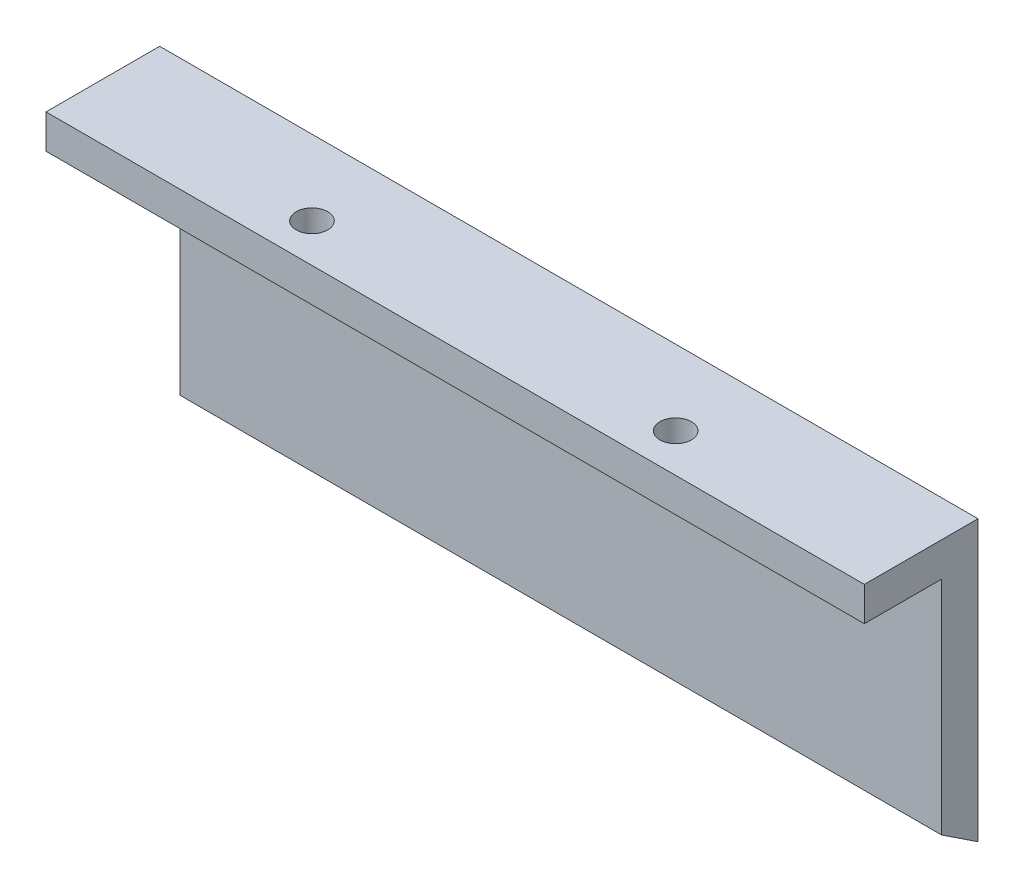
ISO-10303-21;
HEADER;
FILE_DESCRIPTION(('STEP AP214'),'2;1');
FILE_NAME('part.step','',(''),(''),'','','');
FILE_SCHEMA(('AUTOMOTIVE_DESIGN { 1 0 10303 214 1 1 1 1 }'));
ENDSEC;
DATA;
#1=APPLICATION_CONTEXT('core data for automotive mechanical design processes');
#2=APPLICATION_PROTOCOL_DEFINITION('international standard','automotive_design',2000,#1);
#3=PRODUCT_CONTEXT('',#1,'mechanical');
#4=PRODUCT('Part','Part','',(#3));
#5=PRODUCT_RELATED_PRODUCT_CATEGORY('part','',(#4));
#6=PRODUCT_DEFINITION_FORMATION('','',#4);
#7=PRODUCT_DEFINITION_CONTEXT('part definition',#1,'design');
#8=PRODUCT_DEFINITION('design','',#6,#7);
#9=PRODUCT_DEFINITION_SHAPE('','',#8);
#10=(LENGTH_UNIT() NAMED_UNIT(*) SI_UNIT(.MILLI.,.METRE.));
#11=(NAMED_UNIT(*) PLANE_ANGLE_UNIT() SI_UNIT($,.RADIAN.));
#12=(NAMED_UNIT(*) SI_UNIT($,.STERADIAN.) SOLID_ANGLE_UNIT());
#13=UNCERTAINTY_MEASURE_WITH_UNIT(LENGTH_MEASURE(1.E-05),#10,'distance_accuracy_value','');
#14=(GEOMETRIC_REPRESENTATION_CONTEXT(3) GLOBAL_UNCERTAINTY_ASSIGNED_CONTEXT((#13)) GLOBAL_UNIT_ASSIGNED_CONTEXT((#10,
#11,#12)) REPRESENTATION_CONTEXT('',''));
#15=CARTESIAN_POINT('',(0.,0.,0.));
#16=DIRECTION('',(0.,0.,1.));
#17=DIRECTION('',(1.,0.,0.));
#18=AXIS2_PLACEMENT_3D('',#15,#16,#17);
#19=CARTESIAN_POINT('',(47.,28.5412781121806,6.6));
#20=DIRECTION('',(0.,-1.,0.));
#21=DIRECTION('',(0.,0.,-1.));
#22=AXIS2_PLACEMENT_3D('',#19,#20,#21);
#23=CYLINDRICAL_SURFACE('',#22,1.3890625);
#24=CARTESIAN_POINT('',(47.,21.6124160592128,6.6));
#25=DIRECTION('',(0.,-1.,0.));
#26=DIRECTION('',(0.,0.,-1.));
#27=AXIS2_PLACEMENT_3D('',#24,#25,#26);
#28=CIRCLE('',#27,1.3890625);
#29=CARTESIAN_POINT('',(47.,21.6124160592128,5.2109375));
#30=VERTEX_POINT('',#29);
#31=EDGE_CURVE('E112',#30,#30,#28,.F.);
#32=ORIENTED_EDGE('',*,*,#31,.F.);
#33=EDGE_LOOP('',(#32));
#34=FACE_BOUND('',#33,.T.);
#35=CARTESIAN_POINT('',(47.,24.6124160592128,6.6));
#36=DIRECTION('',(0.,-1.,0.));
#37=DIRECTION('',(0.,0.,-1.));
#38=AXIS2_PLACEMENT_3D('',#35,#36,#37);
#39=CIRCLE('',#38,1.3890625);
#40=CARTESIAN_POINT('',(47.,24.6124160592128,5.2109375));
#41=VERTEX_POINT('',#40);
#42=EDGE_CURVE('E20',#41,#41,#39,.F.);
#43=ORIENTED_EDGE('',*,*,#42,.T.);
#44=EDGE_LOOP('',(#43));
#45=FACE_BOUND('',#44,.T.);
#46=ADVANCED_FACE('F17',(#34,#45),#23,.F.);
#47=CARTESIAN_POINT('',(15.,28.5412781121806,6.6));
#48=DIRECTION('',(0.,-1.,0.));
#49=DIRECTION('',(0.,0.,-1.));
#50=AXIS2_PLACEMENT_3D('',#47,#48,#49);
#51=CYLINDRICAL_SURFACE('',#50,1.3890625);
#52=CARTESIAN_POINT('',(15.,21.6124160592128,6.6));
#53=DIRECTION('',(0.,-1.,0.));
#54=DIRECTION('',(0.,0.,-1.));
#55=AXIS2_PLACEMENT_3D('',#52,#53,#54);
#56=CIRCLE('',#55,1.3890625);
#57=CARTESIAN_POINT('',(15.,21.6124160592128,5.21093749999999));
#58=VERTEX_POINT('',#57);
#59=EDGE_CURVE('E108',#58,#58,#56,.F.);
#60=ORIENTED_EDGE('',*,*,#59,.F.);
#61=EDGE_LOOP('',(#60));
#62=FACE_BOUND('',#61,.T.);
#63=CARTESIAN_POINT('',(15.,24.6124160592128,6.6));
#64=DIRECTION('',(0.,-1.,0.));
#65=DIRECTION('',(0.,0.,-1.));
#66=AXIS2_PLACEMENT_3D('',#63,#64,#65);
#67=CIRCLE('',#66,1.3890625);
#68=CARTESIAN_POINT('',(15.,24.6124160592128,5.21093749999999));
#69=VERTEX_POINT('',#68);
#70=EDGE_CURVE('E103',#69,#69,#67,.F.);
#71=ORIENTED_EDGE('',*,*,#70,.T.);
#72=EDGE_LOOP('',(#71));
#73=FACE_BOUND('',#72,.T.);
#74=ADVANCED_FACE('F183',(#62,#73),#51,.F.);
#75=CARTESIAN_POINT('',(67.,24.6124160592128,10.));
#76=DIRECTION('',(0.,0.,-1.));
#77=DIRECTION('',(-1.,0.,0.));
#78=AXIS2_PLACEMENT_3D('',#75,#76,#77);
#79=PLANE('',#78);
#80=DIRECTION('',(0.,1.,0.));
#81=VECTOR('',#80,1.);
#82=CARTESIAN_POINT('',(67.,0.,10.));
#83=LINE('',#82,#81);
#84=CARTESIAN_POINT('',(67.,24.6124160592128,10.));
#85=VERTEX_POINT('',#84);
#86=CARTESIAN_POINT('',(67.,21.6124160592128,10.));
#87=VERTEX_POINT('',#86);
#88=EDGE_CURVE('E88',#85,#87,#83,.F.);
#89=ORIENTED_EDGE('',*,*,#88,.F.);
#90=DIRECTION('',(1.,0.,0.));
#91=VECTOR('',#90,1.);
#92=CARTESIAN_POINT('',(0.,24.6124160592128,10.));
#93=LINE('',#92,#91);
#94=CARTESIAN_POINT('',(-4.99999999999999,24.6124160592128,10.));
#95=VERTEX_POINT('',#94);
#96=EDGE_CURVE('E72',#85,#95,#93,.F.);
#97=ORIENTED_EDGE('',*,*,#96,.T.);
#98=DIRECTION('',(0.,1.,0.));
#99=VECTOR('',#98,1.);
#100=CARTESIAN_POINT('',(-4.99999999999999,24.6124160592128,10.));
#101=LINE('',#100,#99);
#102=CARTESIAN_POINT('',(-4.99999999999999,21.6124160592128,10.));
#103=VERTEX_POINT('',#102);
#104=EDGE_CURVE('E114',#95,#103,#101,.F.);
#105=ORIENTED_EDGE('',*,*,#104,.T.);
#106=DIRECTION('',(1.,0.,0.));
#107=VECTOR('',#106,1.);
#108=CARTESIAN_POINT('',(0.,21.6124160592128,10.));
#109=LINE('',#108,#107);
#110=EDGE_CURVE('E129',#87,#103,#109,.F.);
#111=ORIENTED_EDGE('',*,*,#110,.F.);
#112=EDGE_LOOP('',(#89,#97,#105,#111));
#113=FACE_BOUND('',#112,.T.);
#114=ADVANCED_FACE('F181',(#113),#79,.F.);
#115=CARTESIAN_POINT('',(67.,2.11241605921285,3.2));
#116=DIRECTION('',(0.,0.,-1.));
#117=DIRECTION('',(0.,1.,0.));
#118=AXIS2_PLACEMENT_3D('',#115,#116,#117);
#119=PLANE('',#118);
#120=DIRECTION('',(1.,0.,0.));
#121=VECTOR('',#120,1.);
#122=CARTESIAN_POINT('',(67.,2.11241605921285,3.2));
#123=LINE('',#122,#121);
#124=CARTESIAN_POINT('',(0.,2.11241605921285,3.2));
#125=VERTEX_POINT('',#124);
#126=CARTESIAN_POINT('',(67.,2.11241605921285,3.2));
#127=VERTEX_POINT('',#126);
#128=EDGE_CURVE('E91',#125,#127,#123,.T.);
#129=ORIENTED_EDGE('',*,*,#128,.T.);
#130=DIRECTION('',(0.,1.,0.));
#131=VECTOR('',#130,1.);
#132=CARTESIAN_POINT('',(67.,0.,3.2));
#133=LINE('',#132,#131);
#134=CARTESIAN_POINT('',(67.,21.6124160592128,3.2));
#135=VERTEX_POINT('',#134);
#136=EDGE_CURVE('E78',#135,#127,#133,.F.);
#137=ORIENTED_EDGE('',*,*,#136,.F.);
#138=DIRECTION('',(1.,0.,0.));
#139=VECTOR('',#138,1.);
#140=CARTESIAN_POINT('',(0.,21.6124160592128,3.2));
#141=LINE('',#140,#139);
#142=CARTESIAN_POINT('',(0.,21.6124160592128,3.2));
#143=VERTEX_POINT('',#142);
#144=EDGE_CURVE('E111',#143,#135,#141,.T.);
#145=ORIENTED_EDGE('',*,*,#144,.F.);
#146=DIRECTION('',(0.,1.,0.));
#147=VECTOR('',#146,1.);
#148=CARTESIAN_POINT('',(0.,0.,3.2));
#149=LINE('',#148,#147);
#150=EDGE_CURVE('E93',#143,#125,#149,.F.);
#151=ORIENTED_EDGE('',*,*,#150,.T.);
#152=EDGE_LOOP('',(#129,#137,#145,#151));
#153=FACE_BOUND('',#152,.T.);
#154=ADVANCED_FACE('F92',(#153),#119,.F.);
#155=CARTESIAN_POINT('',(67.,0.,0.));
#156=DIRECTION('',(0.,0.834559517795937,-0.550917789925333));
#157=DIRECTION('',(0.,0.550917789925333,0.834559517795937));
#158=AXIS2_PLACEMENT_3D('',#155,#156,#157);
#159=PLANE('',#158);
#160=DIRECTION('',(1.,0.,0.));
#161=VECTOR('',#160,1.);
#162=CARTESIAN_POINT('',(67.,0.,0.));
#163=LINE('',#162,#161);
#164=CARTESIAN_POINT('',(0.,0.,0.));
#165=VERTEX_POINT('',#164);
#166=CARTESIAN_POINT('',(67.,0.,0.));
#167=VERTEX_POINT('',#166);
#168=EDGE_CURVE('E100',#165,#167,#163,.T.);
#169=ORIENTED_EDGE('',*,*,#168,.T.);
#170=DIRECTION('',(0.,-0.550917789925333,-0.834559517795937));
#171=VECTOR('',#170,1.);
#172=CARTESIAN_POINT('',(67.,2.11241605921285,3.2));
#173=LINE('',#172,#171);
#174=EDGE_CURVE('E83',#127,#167,#173,.T.);
#175=ORIENTED_EDGE('',*,*,#174,.F.);
#176=ORIENTED_EDGE('',*,*,#128,.F.);
#177=DIRECTION('',(0.,-0.550917789925333,-0.834559517795937));
#178=VECTOR('',#177,1.);
#179=CARTESIAN_POINT('',(0.,2.11241605921285,3.2));
#180=LINE('',#179,#178);
#181=EDGE_CURVE('E135',#125,#165,#180,.T.);
#182=ORIENTED_EDGE('',*,*,#181,.T.);
#183=EDGE_LOOP('',(#169,#175,#176,#182));
#184=FACE_BOUND('',#183,.T.);
#185=ADVANCED_FACE('F99',(#184),#159,.F.);
#186=CARTESIAN_POINT('',(67.,0.,0.));
#187=DIRECTION('',(1.,0.,0.));
#188=DIRECTION('',(0.,0.,-1.));
#189=AXIS2_PLACEMENT_3D('',#186,#187,#188);
#190=PLANE('',#189);
#191=ORIENTED_EDGE('',*,*,#136,.T.);
#192=ORIENTED_EDGE('',*,*,#174,.T.);
#193=DIRECTION('',(0.,1.,0.));
#194=VECTOR('',#193,1.);
#195=CARTESIAN_POINT('',(67.,21.6124160592128,0.));
#196=LINE('',#195,#194);
#197=CARTESIAN_POINT('',(67.,24.6124160592128,0.));
#198=VERTEX_POINT('',#197);
#199=EDGE_CURVE('E138',#167,#198,#196,.T.);
#200=ORIENTED_EDGE('',*,*,#199,.T.);
#201=DIRECTION('',(0.,0.,-1.));
#202=VECTOR('',#201,1.);
#203=CARTESIAN_POINT('',(67.,24.6124160592128,0.));
#204=LINE('',#203,#202);
#205=EDGE_CURVE('E118',#198,#85,#204,.F.);
#206=ORIENTED_EDGE('',*,*,#205,.T.);
#207=ORIENTED_EDGE('',*,*,#88,.T.);
#208=DIRECTION('',(0.,0.,-1.));
#209=VECTOR('',#208,1.);
#210=CARTESIAN_POINT('',(67.,21.6124160592128,0.));
#211=LINE('',#210,#209);
#212=EDGE_CURVE('E86',#135,#87,#211,.F.);
#213=ORIENTED_EDGE('',*,*,#212,.F.);
#214=EDGE_LOOP('',(#191,#192,#200,#206,#207,#213));
#215=FACE_BOUND('',#214,.T.);
#216=ADVANCED_FACE('F80',(#215),#190,.T.);
#217=CARTESIAN_POINT('',(0.,24.6124160592128,0.));
#218=DIRECTION('',(0.,-1.,0.));
#219=DIRECTION('',(0.,0.,-1.));
#220=AXIS2_PLACEMENT_3D('',#217,#218,#219);
#221=PLANE('',#220);
#222=DIRECTION('',(1.,0.,0.));
#223=VECTOR('',#222,1.);
#224=CARTESIAN_POINT('',(67.,24.6124160592128,0.));
#225=LINE('',#224,#223);
#226=CARTESIAN_POINT('',(-4.99999999999999,24.6124160592128,0.));
#227=VERTEX_POINT('',#226);
#228=EDGE_CURVE('E140',#198,#227,#225,.F.);
#229=ORIENTED_EDGE('',*,*,#228,.T.);
#230=DIRECTION('',(0.,0.,-1.));
#231=VECTOR('',#230,1.);
#232=CARTESIAN_POINT('',(-4.99999999999999,24.6124160592128,0.));
#233=LINE('',#232,#231);
#234=EDGE_CURVE('E123',#227,#95,#233,.F.);
#235=ORIENTED_EDGE('',*,*,#234,.T.);
#236=ORIENTED_EDGE('',*,*,#96,.F.);
#237=ORIENTED_EDGE('',*,*,#205,.F.);
#238=EDGE_LOOP('',(#229,#235,#236,#237));
#239=FACE_BOUND('',#238,.T.);
#240=ORIENTED_EDGE('',*,*,#70,.F.);
#241=EDGE_LOOP('',(#240));
#242=FACE_BOUND('',#241,.T.);
#243=ORIENTED_EDGE('',*,*,#42,.F.);
#244=EDGE_LOOP('',(#243));
#245=FACE_BOUND('',#244,.T.);
#246=ADVANCED_FACE('F158',(#239,#242,#245),#221,.F.);
#247=CARTESIAN_POINT('',(-4.99999999999999,24.6124160592128,0.));
#248=DIRECTION('',(1.,0.,0.));
#249=DIRECTION('',(0.,0.,-1.));
#250=AXIS2_PLACEMENT_3D('',#247,#248,#249);
#251=PLANE('',#250);
#252=ORIENTED_EDGE('',*,*,#104,.F.);
#253=ORIENTED_EDGE('',*,*,#234,.F.);
#254=DIRECTION('',(0.,1.,0.));
#255=VECTOR('',#254,1.);
#256=CARTESIAN_POINT('',(-4.99999999999999,21.6124160592128,0.));
#257=LINE('',#256,#255);
#258=CARTESIAN_POINT('',(-4.99999999999999,21.6124160592128,0.));
#259=VERTEX_POINT('',#258);
#260=EDGE_CURVE('E143',#227,#259,#257,.F.);
#261=ORIENTED_EDGE('',*,*,#260,.T.);
#262=DIRECTION('',(0.,0.,-1.));
#263=VECTOR('',#262,1.);
#264=CARTESIAN_POINT('',(-4.99999999999999,21.6124160592128,0.));
#265=LINE('',#264,#263);
#266=EDGE_CURVE('E131',#103,#259,#265,.T.);
#267=ORIENTED_EDGE('',*,*,#266,.F.);
#268=EDGE_LOOP('',(#252,#253,#261,#267));
#269=FACE_BOUND('',#268,.T.);
#270=ADVANCED_FACE('F157',(#269),#251,.F.);
#271=CARTESIAN_POINT('',(0.,21.6124160592128,0.));
#272=DIRECTION('',(0.,-1.,0.));
#273=DIRECTION('',(0.,0.,-1.));
#274=AXIS2_PLACEMENT_3D('',#271,#272,#273);
#275=PLANE('',#274);
#276=ORIENTED_EDGE('',*,*,#110,.T.);
#277=ORIENTED_EDGE('',*,*,#266,.T.);
#278=DIRECTION('',(1.,0.,0.));
#279=VECTOR('',#278,1.);
#280=CARTESIAN_POINT('',(67.,21.6124160592128,0.));
#281=LINE('',#280,#279);
#282=CARTESIAN_POINT('',(0.,21.6124160592128,0.));
#283=VERTEX_POINT('',#282);
#284=EDGE_CURVE('E26',#259,#283,#281,.T.);
#285=ORIENTED_EDGE('',*,*,#284,.T.);
#286=DIRECTION('',(0.,0.,-1.));
#287=VECTOR('',#286,1.);
#288=CARTESIAN_POINT('',(0.,21.6124160592128,0.));
#289=LINE('',#288,#287);
#290=EDGE_CURVE('E34',#283,#143,#289,.F.);
#291=ORIENTED_EDGE('',*,*,#290,.T.);
#292=ORIENTED_EDGE('',*,*,#144,.T.);
#293=ORIENTED_EDGE('',*,*,#212,.T.);
#294=EDGE_LOOP('',(#276,#277,#285,#291,#292,#293));
#295=FACE_BOUND('',#294,.T.);
#296=ORIENTED_EDGE('',*,*,#59,.T.);
#297=EDGE_LOOP('',(#296));
#298=FACE_BOUND('',#297,.T.);
#299=ORIENTED_EDGE('',*,*,#31,.T.);
#300=EDGE_LOOP('',(#299));
#301=FACE_BOUND('',#300,.T.);
#302=ADVANCED_FACE('F149',(#295,#298,#301),#275,.T.);
#303=CARTESIAN_POINT('',(0.,0.,0.));
#304=DIRECTION('',(1.,0.,0.));
#305=DIRECTION('',(0.,0.,-1.));
#306=AXIS2_PLACEMENT_3D('',#303,#304,#305);
#307=PLANE('',#306);
#308=ORIENTED_EDGE('',*,*,#181,.F.);
#309=ORIENTED_EDGE('',*,*,#150,.F.);
#310=ORIENTED_EDGE('',*,*,#290,.F.);
#311=DIRECTION('',(0.,1.,0.));
#312=VECTOR('',#311,1.);
#313=CARTESIAN_POINT('',(0.,21.6124160592128,0.));
#314=LINE('',#313,#312);
#315=EDGE_CURVE('E11',#283,#165,#314,.F.);
#316=ORIENTED_EDGE('',*,*,#315,.T.);
#317=EDGE_LOOP('',(#308,#309,#310,#316));
#318=FACE_BOUND('',#317,.T.);
#319=ADVANCED_FACE('F160',(#318),#307,.F.);
#320=CARTESIAN_POINT('',(67.,21.6124160592128,0.));
#321=DIRECTION('',(0.,0.,1.));
#322=DIRECTION('',(1.,0.,0.));
#323=AXIS2_PLACEMENT_3D('',#320,#321,#322);
#324=PLANE('',#323);
#325=ORIENTED_EDGE('',*,*,#284,.F.);
#326=ORIENTED_EDGE('',*,*,#260,.F.);
#327=ORIENTED_EDGE('',*,*,#228,.F.);
#328=ORIENTED_EDGE('',*,*,#199,.F.);
#329=ORIENTED_EDGE('',*,*,#168,.F.);
#330=ORIENTED_EDGE('',*,*,#315,.F.);
#331=EDGE_LOOP('',(#325,#326,#327,#328,#329,#330));
#332=FACE_BOUND('',#331,.T.);
#333=ADVANCED_FACE('F154',(#332),#324,.F.);
#334=CLOSED_SHELL('',(#46,#74,#114,#154,#185,#216,#246,#270,#302,#319,#333));
#335=MANIFOLD_SOLID_BREP('B1',#334);
#336=ADVANCED_BREP_SHAPE_REPRESENTATION('',(#18,#335),#14);
#337=SHAPE_DEFINITION_REPRESENTATION(#9,#336);
ENDSEC;
END-ISO-10303-21;
